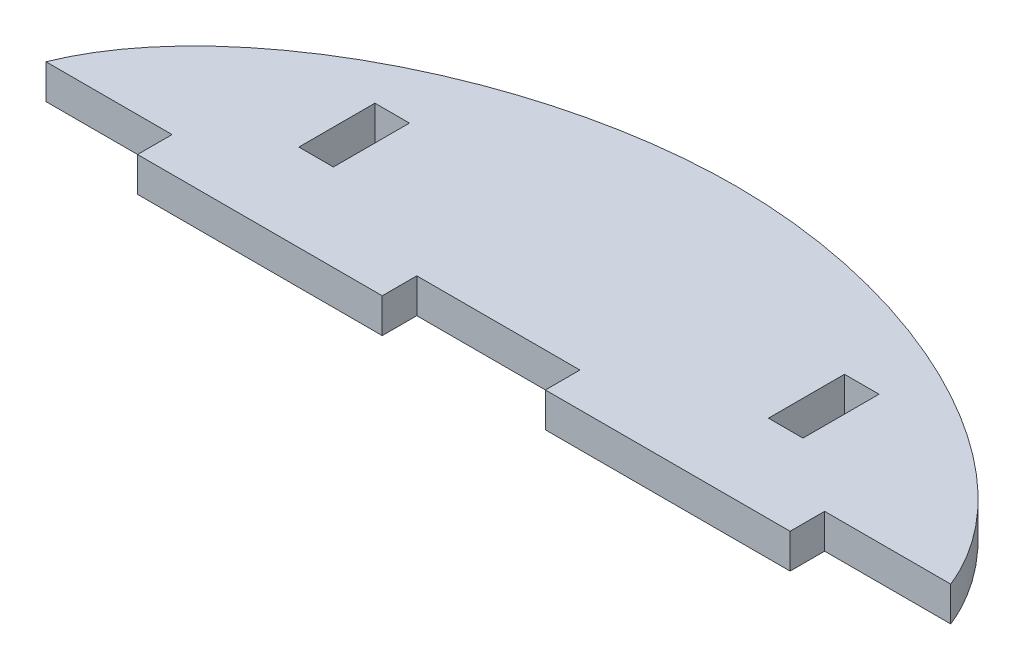
ISO-10303-21;
HEADER;
FILE_DESCRIPTION(('STEP AP214'),'2;1');
FILE_NAME('part.step','',(''),(''),'','','');
FILE_SCHEMA(('AUTOMOTIVE_DESIGN { 1 0 10303 214 1 1 1 1 }'));
ENDSEC;
DATA;
#1=APPLICATION_CONTEXT('core data for automotive mechanical design processes');
#2=APPLICATION_PROTOCOL_DEFINITION('international standard','automotive_design',2000,#1);
#3=PRODUCT_CONTEXT('',#1,'mechanical');
#4=PRODUCT('Part','Part','',(#3));
#5=PRODUCT_RELATED_PRODUCT_CATEGORY('part','',(#4));
#6=PRODUCT_DEFINITION_FORMATION('','',#4);
#7=PRODUCT_DEFINITION_CONTEXT('part definition',#1,'design');
#8=PRODUCT_DEFINITION('design','',#6,#7);
#9=PRODUCT_DEFINITION_SHAPE('','',#8);
#10=(LENGTH_UNIT() NAMED_UNIT(*) SI_UNIT(.MILLI.,.METRE.));
#11=(NAMED_UNIT(*) PLANE_ANGLE_UNIT() SI_UNIT($,.RADIAN.));
#12=(NAMED_UNIT(*) SI_UNIT($,.STERADIAN.) SOLID_ANGLE_UNIT());
#13=UNCERTAINTY_MEASURE_WITH_UNIT(LENGTH_MEASURE(1.E-05),#10,'distance_accuracy_value','');
#14=(GEOMETRIC_REPRESENTATION_CONTEXT(3) GLOBAL_UNCERTAINTY_ASSIGNED_CONTEXT((#13)) GLOBAL_UNIT_ASSIGNED_CONTEXT((#10,
#11,#12)) REPRESENTATION_CONTEXT('',''));
#15=CARTESIAN_POINT('',(0.,0.,0.));
#16=DIRECTION('',(0.,0.,1.));
#17=DIRECTION('',(1.,0.,0.));
#18=AXIS2_PLACEMENT_3D('',#15,#16,#17);
#19=CARTESIAN_POINT('',(0.,3.175,0.));
#20=DIRECTION('',(0.,0.,-1.));
#21=DIRECTION('',(-1.,0.,0.));
#22=AXIS2_PLACEMENT_3D('',#19,#20,#21);
#23=PLANE('',#22);
#24=DIRECTION('',(1.,0.,0.));
#25=VECTOR('',#24,1.);
#26=CARTESIAN_POINT('',(0.,3.175,0.));
#27=LINE('',#26,#25);
#28=CARTESIAN_POINT('',(50.,3.175,0.));
#29=VERTEX_POINT('',#28);
#30=CARTESIAN_POINT('',(72.5,3.175,0.));
#31=VERTEX_POINT('',#30);
#32=EDGE_CURVE('E294',#29,#31,#27,.T.);
#33=ORIENTED_EDGE('',*,*,#32,.F.);
#34=DIRECTION('',(0.,-1.,0.));
#35=VECTOR('',#34,1.);
#36=CARTESIAN_POINT('',(50.,3.175,0.));
#37=LINE('',#36,#35);
#38=CARTESIAN_POINT('',(50.,0.,0.));
#39=VERTEX_POINT('',#38);
#40=EDGE_CURVE('E198',#29,#39,#37,.T.);
#41=ORIENTED_EDGE('',*,*,#40,.T.);
#42=DIRECTION('',(1.,0.,0.));
#43=VECTOR('',#42,1.);
#44=CARTESIAN_POINT('',(0.,0.,0.));
#45=LINE('',#44,#43);
#46=CARTESIAN_POINT('',(72.5,0.,0.));
#47=VERTEX_POINT('',#46);
#48=EDGE_CURVE('E304',#39,#47,#45,.T.);
#49=ORIENTED_EDGE('',*,*,#48,.T.);
#50=DIRECTION('',(0.,-1.,0.));
#51=VECTOR('',#50,1.);
#52=CARTESIAN_POINT('',(72.5,3.175,0.));
#53=LINE('',#52,#51);
#54=EDGE_CURVE('E249',#31,#47,#53,.T.);
#55=ORIENTED_EDGE('',*,*,#54,.F.);
#56=EDGE_LOOP('',(#33,#41,#49,#55));
#57=FACE_BOUND('',#56,.T.);
#58=ADVANCED_FACE('F32',(#57),#23,.F.);
#59=CARTESIAN_POINT('',(0.,3.175,0.));
#60=CARTESIAN_POINT('',(2.31530903555912,3.175,-13.1307700401628));
#61=CARTESIAN_POINT('',(42.5000000000001,3.175,-36.8692299598373));
#62=CARTESIAN_POINT('',(82.6846909644409,3.175,-13.1307700401627));
#63=CARTESIAN_POINT('',(85.,3.175,0.));
#64=B_SPLINE_CURVE_WITH_KNOTS('',3,(#59,#60,#61,#62,#63),.UNSPECIFIED.,.F.,.F.,(4,1,4),(0.,
0.499999999999999,1.),.UNSPECIFIED.);
#65=DIRECTION('',(0.,-1.,0.));
#66=VECTOR('',#65,1.);
#67=SURFACE_OF_LINEAR_EXTRUSION('',#64,#66);
#68=DIRECTION('',(0.,-1.,0.));
#69=VECTOR('',#68,1.);
#70=CARTESIAN_POINT('',(0.908888664601335,3.175,-3.17499999999998));
#71=LINE('',#70,#69);
#72=CARTESIAN_POINT('',(0.908888664601547,3.175,-3.17499999999998));
#73=VERTEX_POINT('',#72);
#74=CARTESIAN_POINT('',(0.908888664601547,0.,-3.17500000000051));
#75=VERTEX_POINT('',#74);
#76=EDGE_CURVE('E256',#73,#75,#71,.T.);
#77=ORIENTED_EDGE('',*,*,#76,.F.);
#78=CARTESIAN_POINT('',(84.0911113353985,3.175,-3.17499999999997));
#79=VERTEX_POINT('',#78);
#80=EDGE_CURVE('E181',#73,#79,#64,.T.);
#81=ORIENTED_EDGE('',*,*,#80,.T.);
#82=DIRECTION('',(0.,-1.,0.));
#83=VECTOR('',#82,1.);
#84=CARTESIAN_POINT('',(84.0911113353986,3.175,-3.17499999999997));
#85=LINE('',#84,#83);
#86=CARTESIAN_POINT('',(84.0911113353985,0.,-3.17499999999997));
#87=VERTEX_POINT('',#86);
#88=EDGE_CURVE('E237',#87,#79,#85,.F.);
#89=ORIENTED_EDGE('',*,*,#88,.F.);
#90=CARTESIAN_POINT('',(0.,0.,0.));
#91=CARTESIAN_POINT('',(2.31530903555912,0.,-13.1307700401628));
#92=CARTESIAN_POINT('',(42.5000000000001,0.,-36.8692299598373));
#93=CARTESIAN_POINT('',(82.6846909644409,0.,-13.1307700401627));
#94=CARTESIAN_POINT('',(85.,0.,0.));
#95=B_SPLINE_CURVE_WITH_KNOTS('',3,(#90,#91,#92,#93,#94),.UNSPECIFIED.,.F.,.F.,(4,1,4),(0.,
0.499999999999999,1.),.UNSPECIFIED.);
#96=EDGE_CURVE('E284',#75,#87,#95,.T.);
#97=ORIENTED_EDGE('',*,*,#96,.F.);
#98=EDGE_LOOP('',(#77,#81,#89,#97));
#99=FACE_BOUND('',#98,.T.);
#100=ADVANCED_FACE('F34',(#99),#67,.T.);
#101=CARTESIAN_POINT('',(12.5,0.,0.));
#102=VERTEX_POINT('',#101);
#103=CARTESIAN_POINT('',(35.,0.,0.));
#104=VERTEX_POINT('',#103);
#105=EDGE_CURVE('E295',#102,#104,#45,.T.);
#106=ORIENTED_EDGE('',*,*,#105,.T.);
#107=DIRECTION('',(0.,-1.,0.));
#108=VECTOR('',#107,1.);
#109=CARTESIAN_POINT('',(35.,3.175,0.));
#110=LINE('',#109,#108);
#111=CARTESIAN_POINT('',(35.,3.175,0.));
#112=VERTEX_POINT('',#111);
#113=EDGE_CURVE('E209',#112,#104,#110,.T.);
#114=ORIENTED_EDGE('',*,*,#113,.F.);
#115=CARTESIAN_POINT('',(12.5,3.175,0.));
#116=VERTEX_POINT('',#115);
#117=EDGE_CURVE('E41',#116,#112,#27,.T.);
#118=ORIENTED_EDGE('',*,*,#117,.F.);
#119=DIRECTION('',(0.,-1.,0.));
#120=VECTOR('',#119,1.);
#121=CARTESIAN_POINT('',(12.5,3.175,0.));
#122=LINE('',#121,#120);
#123=EDGE_CURVE('E165',#116,#102,#122,.T.);
#124=ORIENTED_EDGE('',*,*,#123,.T.);
#125=EDGE_LOOP('',(#106,#114,#118,#124));
#126=FACE_BOUND('',#125,.T.);
#127=ADVANCED_FACE('F316',(#126),#23,.F.);
#128=CARTESIAN_POINT('',(0.,3.175,0.));
#129=DIRECTION('',(0.,1.,0.));
#130=DIRECTION('',(0.,0.,1.));
#131=AXIS2_PLACEMENT_3D('',#128,#129,#130);
#132=PLANE('',#131);
#133=DIRECTION('',(0.,0.,1.));
#134=VECTOR('',#133,1.);
#135=CARTESIAN_POINT('',(50.,3.175,0.));
#136=LINE('',#135,#134);
#137=CARTESIAN_POINT('',(50.,3.175,-3.17499999999997));
#138=VERTEX_POINT('',#137);
#139=EDGE_CURVE('E189',#138,#29,#136,.T.);
#140=ORIENTED_EDGE('',*,*,#139,.T.);
#141=ORIENTED_EDGE('',*,*,#32,.T.);
#142=DIRECTION('',(0.,0.,-1.));
#143=VECTOR('',#142,1.);
#144=CARTESIAN_POINT('',(72.5,3.175,0.));
#145=LINE('',#144,#143);
#146=CARTESIAN_POINT('',(72.5,3.175,-3.17499999999997));
#147=VERTEX_POINT('',#146);
#148=EDGE_CURVE('E243',#31,#147,#145,.T.);
#149=ORIENTED_EDGE('',*,*,#148,.T.);
#150=DIRECTION('',(1.,0.,0.));
#151=VECTOR('',#150,1.);
#152=CARTESIAN_POINT('',(85.,3.175,-3.17499999999997));
#153=LINE('',#152,#151);
#154=EDGE_CURVE('E246',#147,#79,#153,.T.);
#155=ORIENTED_EDGE('',*,*,#154,.T.);
#156=ORIENTED_EDGE('',*,*,#80,.F.);
#157=DIRECTION('',(1.,0.,0.));
#158=VECTOR('',#157,1.);
#159=CARTESIAN_POINT('',(0.,3.175,-3.17499999999998));
#160=LINE('',#159,#158);
#161=CARTESIAN_POINT('',(12.5,3.175,-3.17499999999998));
#162=VERTEX_POINT('',#161);
#163=EDGE_CURVE('E161',#73,#162,#160,.T.);
#164=ORIENTED_EDGE('',*,*,#163,.T.);
#165=DIRECTION('',(0.,0.,1.));
#166=VECTOR('',#165,1.);
#167=CARTESIAN_POINT('',(12.5,3.175,0.));
#168=LINE('',#167,#166);
#169=EDGE_CURVE('E166',#162,#116,#168,.T.);
#170=ORIENTED_EDGE('',*,*,#169,.T.);
#171=ORIENTED_EDGE('',*,*,#117,.T.);
#172=DIRECTION('',(0.,0.,-1.));
#173=VECTOR('',#172,1.);
#174=CARTESIAN_POINT('',(35.,3.175,0.));
#175=LINE('',#174,#173);
#176=CARTESIAN_POINT('',(35.,3.175,-3.17499999999997));
#177=VERTEX_POINT('',#176);
#178=EDGE_CURVE('E191',#112,#177,#175,.T.);
#179=ORIENTED_EDGE('',*,*,#178,.T.);
#180=DIRECTION('',(1.,0.,0.));
#181=VECTOR('',#180,1.);
#182=CARTESIAN_POINT('',(50.,3.175,-3.17499999999997));
#183=LINE('',#182,#181);
#184=EDGE_CURVE('E195',#177,#138,#183,.T.);
#185=ORIENTED_EDGE('',*,*,#184,.T.);
#186=EDGE_LOOP('',(#140,#141,#149,#155,#156,#164,#170,#171,#179,#185));
#187=FACE_BOUND('',#186,.T.);
#188=DIRECTION('',(0.,0.,1.));
#189=VECTOR('',#188,1.);
#190=CARTESIAN_POINT('',(22.4999999999998,3.175,-15.0000000000001));
#191=LINE('',#190,#189);
#192=CARTESIAN_POINT('',(22.4999999999998,3.175,-15.0000000000001));
#193=VERTEX_POINT('',#192);
#194=CARTESIAN_POINT('',(22.4999999999998,3.175,-8.00800000000014));
#195=VERTEX_POINT('',#194);
#196=EDGE_CURVE('E213',#193,#195,#191,.T.);
#197=ORIENTED_EDGE('',*,*,#196,.T.);
#198=DIRECTION('',(-1.,0.,0.));
#199=VECTOR('',#198,1.);
#200=CARTESIAN_POINT('',(22.4999999999998,3.175,-8.00800000000014));
#201=LINE('',#200,#199);
#202=CARTESIAN_POINT('',(19.3249999999999,3.175,-8.00800000000014));
#203=VERTEX_POINT('',#202);
#204=EDGE_CURVE('E216',#195,#203,#201,.T.);
#205=ORIENTED_EDGE('',*,*,#204,.T.);
#206=DIRECTION('',(0.,0.,-1.));
#207=VECTOR('',#206,1.);
#208=CARTESIAN_POINT('',(19.3249999999999,3.175,-15.0000000000001));
#209=LINE('',#208,#207);
#210=CARTESIAN_POINT('',(19.3249999999999,3.175,-15.0000000000001));
#211=VERTEX_POINT('',#210);
#212=EDGE_CURVE('E48',#203,#211,#209,.T.);
#213=ORIENTED_EDGE('',*,*,#212,.T.);
#214=DIRECTION('',(1.,0.,0.));
#215=VECTOR('',#214,1.);
#216=CARTESIAN_POINT('',(22.4999999999998,3.175,-15.0000000000001));
#217=LINE('',#216,#215);
#218=EDGE_CURVE('E221',#211,#193,#217,.T.);
#219=ORIENTED_EDGE('',*,*,#218,.T.);
#220=EDGE_LOOP('',(#197,#205,#213,#219));
#221=FACE_BOUND('',#220,.T.);
#222=DIRECTION('',(0.,0.,1.));
#223=VECTOR('',#222,1.);
#224=CARTESIAN_POINT('',(65.6749999999998,3.175,-15.0000000000005));
#225=LINE('',#224,#223);
#226=CARTESIAN_POINT('',(65.6749999999998,3.175,-15.0000000000005));
#227=VERTEX_POINT('',#226);
#228=CARTESIAN_POINT('',(65.6749999999998,3.175,-8.00800000000046));
#229=VERTEX_POINT('',#228);
#230=EDGE_CURVE('E259',#227,#229,#225,.T.);
#231=ORIENTED_EDGE('',*,*,#230,.T.);
#232=DIRECTION('',(-1.,0.,0.));
#233=VECTOR('',#232,1.);
#234=CARTESIAN_POINT('',(65.6749999999998,3.175,-8.00800000000046));
#235=LINE('',#234,#233);
#236=CARTESIAN_POINT('',(62.4999999999999,3.175,-8.00800000000046));
#237=VERTEX_POINT('',#236);
#238=EDGE_CURVE('E262',#229,#237,#235,.T.);
#239=ORIENTED_EDGE('',*,*,#238,.T.);
#240=DIRECTION('',(0.,0.,-1.));
#241=VECTOR('',#240,1.);
#242=CARTESIAN_POINT('',(62.4999999999999,3.175,-15.0000000000005));
#243=LINE('',#242,#241);
#244=CARTESIAN_POINT('',(62.4999999999999,3.175,-15.0000000000005));
#245=VERTEX_POINT('',#244);
#246=EDGE_CURVE('E266',#237,#245,#243,.T.);
#247=ORIENTED_EDGE('',*,*,#246,.T.);
#248=DIRECTION('',(1.,0.,0.));
#249=VECTOR('',#248,1.);
#250=CARTESIAN_POINT('',(65.6749999999998,3.175,-15.0000000000005));
#251=LINE('',#250,#249);
#252=EDGE_CURVE('E269',#245,#227,#251,.T.);
#253=ORIENTED_EDGE('',*,*,#252,.T.);
#254=EDGE_LOOP('',(#231,#239,#247,#253));
#255=FACE_BOUND('',#254,.T.);
#256=ADVANCED_FACE('F177',(#187,#221,#255),#132,.T.);
#257=CARTESIAN_POINT('',(0.,0.,0.));
#258=DIRECTION('',(0.,1.,0.));
#259=DIRECTION('',(0.,0.,1.));
#260=AXIS2_PLACEMENT_3D('',#257,#258,#259);
#261=PLANE('',#260);
#262=DIRECTION('',(-1.,0.,0.));
#263=VECTOR('',#262,1.);
#264=CARTESIAN_POINT('',(22.4999999999998,0.,-8.00800000000014));
#265=LINE('',#264,#263);
#266=CARTESIAN_POINT('',(22.4999999999998,0.,-8.00800000000014));
#267=VERTEX_POINT('',#266);
#268=CARTESIAN_POINT('',(19.3249999999999,0.,-8.00800000000014));
#269=VERTEX_POINT('',#268);
#270=EDGE_CURVE('E226',#267,#269,#265,.T.);
#271=ORIENTED_EDGE('',*,*,#270,.F.);
#272=DIRECTION('',(0.,0.,1.));
#273=VECTOR('',#272,1.);
#274=CARTESIAN_POINT('',(22.4999999999998,0.,-15.0000000000001));
#275=LINE('',#274,#273);
#276=CARTESIAN_POINT('',(22.4999999999998,0.,-15.0000000000001));
#277=VERTEX_POINT('',#276);
#278=EDGE_CURVE('E56',#277,#267,#275,.T.);
#279=ORIENTED_EDGE('',*,*,#278,.F.);
#280=DIRECTION('',(1.,0.,0.));
#281=VECTOR('',#280,1.);
#282=CARTESIAN_POINT('',(22.4999999999998,0.,-15.0000000000001));
#283=LINE('',#282,#281);
#284=CARTESIAN_POINT('',(19.3249999999999,0.,-15.0000000000001));
#285=VERTEX_POINT('',#284);
#286=EDGE_CURVE('E217',#285,#277,#283,.T.);
#287=ORIENTED_EDGE('',*,*,#286,.F.);
#288=DIRECTION('',(0.,0.,-1.));
#289=VECTOR('',#288,1.);
#290=CARTESIAN_POINT('',(19.3249999999999,0.,-15.0000000000001));
#291=LINE('',#290,#289);
#292=EDGE_CURVE('E230',#269,#285,#291,.T.);
#293=ORIENTED_EDGE('',*,*,#292,.F.);
#294=EDGE_LOOP('',(#271,#279,#287,#293));
#295=FACE_BOUND('',#294,.T.);
#296=DIRECTION('',(-1.,0.,0.));
#297=VECTOR('',#296,1.);
#298=CARTESIAN_POINT('',(65.6749999999998,0.,-8.00800000000046));
#299=LINE('',#298,#297);
#300=CARTESIAN_POINT('',(65.6749999999998,0.,-8.00800000000046));
#301=VERTEX_POINT('',#300);
#302=CARTESIAN_POINT('',(62.4999999999999,0.,-8.00800000000046));
#303=VERTEX_POINT('',#302);
#304=EDGE_CURVE('E274',#301,#303,#299,.T.);
#305=ORIENTED_EDGE('',*,*,#304,.F.);
#306=DIRECTION('',(0.,0.,1.));
#307=VECTOR('',#306,1.);
#308=CARTESIAN_POINT('',(65.6749999999998,0.,-15.0000000000005));
#309=LINE('',#308,#307);
#310=CARTESIAN_POINT('',(65.6749999999998,0.,-15.0000000000005));
#311=VERTEX_POINT('',#310);
#312=EDGE_CURVE('E258',#311,#301,#309,.T.);
#313=ORIENTED_EDGE('',*,*,#312,.F.);
#314=DIRECTION('',(1.,0.,0.));
#315=VECTOR('',#314,1.);
#316=CARTESIAN_POINT('',(65.6749999999998,0.,-15.0000000000005));
#317=LINE('',#316,#315);
#318=CARTESIAN_POINT('',(62.4999999999999,0.,-15.0000000000005));
#319=VERTEX_POINT('',#318);
#320=EDGE_CURVE('E263',#319,#311,#317,.T.);
#321=ORIENTED_EDGE('',*,*,#320,.F.);
#322=DIRECTION('',(0.,0.,-1.));
#323=VECTOR('',#322,1.);
#324=CARTESIAN_POINT('',(62.4999999999999,0.,-15.0000000000005));
#325=LINE('',#324,#323);
#326=EDGE_CURVE('E277',#303,#319,#325,.T.);
#327=ORIENTED_EDGE('',*,*,#326,.F.);
#328=EDGE_LOOP('',(#305,#313,#321,#327));
#329=FACE_BOUND('',#328,.T.);
#330=ORIENTED_EDGE('',*,*,#48,.F.);
#331=DIRECTION('',(0.,0.,1.));
#332=VECTOR('',#331,1.);
#333=CARTESIAN_POINT('',(50.,0.,0.));
#334=LINE('',#333,#332);
#335=CARTESIAN_POINT('',(50.,0.,-3.17499999999997));
#336=VERTEX_POINT('',#335);
#337=EDGE_CURVE('E199',#336,#39,#334,.T.);
#338=ORIENTED_EDGE('',*,*,#337,.F.);
#339=DIRECTION('',(1.,0.,0.));
#340=VECTOR('',#339,1.);
#341=CARTESIAN_POINT('',(50.,0.,-3.17499999999997));
#342=LINE('',#341,#340);
#343=CARTESIAN_POINT('',(35.,0.,-3.17499999999997));
#344=VERTEX_POINT('',#343);
#345=EDGE_CURVE('E192',#344,#336,#342,.T.);
#346=ORIENTED_EDGE('',*,*,#345,.F.);
#347=DIRECTION('',(0.,0.,-1.));
#348=VECTOR('',#347,1.);
#349=CARTESIAN_POINT('',(35.,0.,0.));
#350=LINE('',#349,#348);
#351=EDGE_CURVE('E201',#104,#344,#350,.T.);
#352=ORIENTED_EDGE('',*,*,#351,.F.);
#353=ORIENTED_EDGE('',*,*,#105,.F.);
#354=DIRECTION('',(0.,0.,1.));
#355=VECTOR('',#354,1.);
#356=CARTESIAN_POINT('',(12.5,0.,0.));
#357=LINE('',#356,#355);
#358=CARTESIAN_POINT('',(12.5,0.,-3.17499999999998));
#359=VERTEX_POINT('',#358);
#360=EDGE_CURVE('E182',#359,#102,#357,.T.);
#361=ORIENTED_EDGE('',*,*,#360,.F.);
#362=DIRECTION('',(-1.,0.,0.));
#363=VECTOR('',#362,1.);
#364=CARTESIAN_POINT('',(0.,0.,-3.17499999999998));
#365=LINE('',#364,#363);
#366=EDGE_CURVE('E11',#359,#75,#365,.T.);
#367=ORIENTED_EDGE('',*,*,#366,.T.);
#368=ORIENTED_EDGE('',*,*,#96,.T.);
#369=DIRECTION('',(1.,0.,0.));
#370=VECTOR('',#369,1.);
#371=CARTESIAN_POINT('',(85.,0.,-3.17499999999997));
#372=LINE('',#371,#370);
#373=CARTESIAN_POINT('',(72.5,0.,-3.17499999999997));
#374=VERTEX_POINT('',#373);
#375=EDGE_CURVE('E247',#374,#87,#372,.T.);
#376=ORIENTED_EDGE('',*,*,#375,.F.);
#377=DIRECTION('',(0.,0.,-1.));
#378=VECTOR('',#377,1.);
#379=CARTESIAN_POINT('',(72.5,0.,0.));
#380=LINE('',#379,#378);
#381=EDGE_CURVE('E187',#47,#374,#380,.T.);
#382=ORIENTED_EDGE('',*,*,#381,.F.);
#383=EDGE_LOOP('',(#330,#338,#346,#352,#353,#361,#367,#368,#376,#382));
#384=FACE_BOUND('',#383,.T.);
#385=ADVANCED_FACE('F319',(#295,#329,#384),#261,.F.);
#386=CARTESIAN_POINT('',(65.6749999999998,3.175,-15.0000000000005));
#387=DIRECTION('',(1.,0.,0.));
#388=DIRECTION('',(0.,0.,-1.));
#389=AXIS2_PLACEMENT_3D('',#386,#387,#388);
#390=PLANE('',#389);
#391=ORIENTED_EDGE('',*,*,#312,.T.);
#392=DIRECTION('',(0.,-1.,0.));
#393=VECTOR('',#392,1.);
#394=CARTESIAN_POINT('',(65.6749999999998,3.175,-8.00800000000046));
#395=LINE('',#394,#393);
#396=EDGE_CURVE('E272',#229,#301,#395,.T.);
#397=ORIENTED_EDGE('',*,*,#396,.F.);
#398=ORIENTED_EDGE('',*,*,#230,.F.);
#399=DIRECTION('',(0.,-1.,0.));
#400=VECTOR('',#399,1.);
#401=CARTESIAN_POINT('',(65.6749999999998,3.175,-15.0000000000005));
#402=LINE('',#401,#400);
#403=EDGE_CURVE('E282',#227,#311,#402,.T.);
#404=ORIENTED_EDGE('',*,*,#403,.T.);
#405=EDGE_LOOP('',(#391,#397,#398,#404));
#406=FACE_BOUND('',#405,.T.);
#407=ADVANCED_FACE('F366',(#406),#390,.F.);
#408=CARTESIAN_POINT('',(65.6749999999998,3.175,-15.0000000000005));
#409=DIRECTION('',(0.,0.,-1.));
#410=DIRECTION('',(-1.,0.,0.));
#411=AXIS2_PLACEMENT_3D('',#408,#409,#410);
#412=PLANE('',#411);
#413=ORIENTED_EDGE('',*,*,#320,.T.);
#414=ORIENTED_EDGE('',*,*,#403,.F.);
#415=ORIENTED_EDGE('',*,*,#252,.F.);
#416=DIRECTION('',(0.,-1.,0.));
#417=VECTOR('',#416,1.);
#418=CARTESIAN_POINT('',(62.4999999999999,3.175,-15.0000000000005));
#419=LINE('',#418,#417);
#420=EDGE_CURVE('E285',#245,#319,#419,.T.);
#421=ORIENTED_EDGE('',*,*,#420,.T.);
#422=EDGE_LOOP('',(#413,#414,#415,#421));
#423=FACE_BOUND('',#422,.T.);
#424=ADVANCED_FACE('F371',(#423),#412,.F.);
#425=CARTESIAN_POINT('',(62.4999999999999,3.175,-15.0000000000005));
#426=DIRECTION('',(-1.,0.,0.));
#427=DIRECTION('',(0.,0.,1.));
#428=AXIS2_PLACEMENT_3D('',#425,#426,#427);
#429=PLANE('',#428);
#430=ORIENTED_EDGE('',*,*,#326,.T.);
#431=ORIENTED_EDGE('',*,*,#420,.F.);
#432=ORIENTED_EDGE('',*,*,#246,.F.);
#433=DIRECTION('',(0.,-1.,0.));
#434=VECTOR('',#433,1.);
#435=CARTESIAN_POINT('',(62.4999999999999,3.175,-8.00800000000046));
#436=LINE('',#435,#434);
#437=EDGE_CURVE('E287',#237,#303,#436,.T.);
#438=ORIENTED_EDGE('',*,*,#437,.T.);
#439=EDGE_LOOP('',(#430,#431,#432,#438));
#440=FACE_BOUND('',#439,.T.);
#441=ADVANCED_FACE('F377',(#440),#429,.F.);
#442=CARTESIAN_POINT('',(65.6749999999998,3.175,-8.00800000000046));
#443=DIRECTION('',(0.,0.,1.));
#444=DIRECTION('',(1.,0.,0.));
#445=AXIS2_PLACEMENT_3D('',#442,#443,#444);
#446=PLANE('',#445);
#447=ORIENTED_EDGE('',*,*,#304,.T.);
#448=ORIENTED_EDGE('',*,*,#437,.F.);
#449=ORIENTED_EDGE('',*,*,#238,.F.);
#450=ORIENTED_EDGE('',*,*,#396,.T.);
#451=EDGE_LOOP('',(#447,#448,#449,#450));
#452=FACE_BOUND('',#451,.T.);
#453=ADVANCED_FACE('F373',(#452),#446,.F.);
#454=CARTESIAN_POINT('',(22.4999999999998,3.175,-15.0000000000001));
#455=DIRECTION('',(1.,0.,0.));
#456=DIRECTION('',(0.,0.,-1.));
#457=AXIS2_PLACEMENT_3D('',#454,#455,#456);
#458=PLANE('',#457);
#459=ORIENTED_EDGE('',*,*,#278,.T.);
#460=DIRECTION('',(0.,-1.,0.));
#461=VECTOR('',#460,1.);
#462=CARTESIAN_POINT('',(22.4999999999998,3.175,-8.00800000000014));
#463=LINE('',#462,#461);
#464=EDGE_CURVE('E224',#195,#267,#463,.T.);
#465=ORIENTED_EDGE('',*,*,#464,.F.);
#466=ORIENTED_EDGE('',*,*,#196,.F.);
#467=DIRECTION('',(0.,-1.,0.));
#468=VECTOR('',#467,1.);
#469=CARTESIAN_POINT('',(22.4999999999998,3.175,-15.0000000000001));
#470=LINE('',#469,#468);
#471=EDGE_CURVE('E235',#193,#277,#470,.T.);
#472=ORIENTED_EDGE('',*,*,#471,.T.);
#473=EDGE_LOOP('',(#459,#465,#466,#472));
#474=FACE_BOUND('',#473,.T.);
#475=ADVANCED_FACE('F376',(#474),#458,.F.);
#476=CARTESIAN_POINT('',(22.4999999999998,3.175,-15.0000000000001));
#477=DIRECTION('',(0.,0.,-1.));
#478=DIRECTION('',(-1.,0.,0.));
#479=AXIS2_PLACEMENT_3D('',#476,#477,#478);
#480=PLANE('',#479);
#481=ORIENTED_EDGE('',*,*,#286,.T.);
#482=ORIENTED_EDGE('',*,*,#471,.F.);
#483=ORIENTED_EDGE('',*,*,#218,.F.);
#484=DIRECTION('',(0.,-1.,0.));
#485=VECTOR('',#484,1.);
#486=CARTESIAN_POINT('',(19.3249999999999,3.175,-15.0000000000001));
#487=LINE('',#486,#485);
#488=EDGE_CURVE('E238',#211,#285,#487,.T.);
#489=ORIENTED_EDGE('',*,*,#488,.T.);
#490=EDGE_LOOP('',(#481,#482,#483,#489));
#491=FACE_BOUND('',#490,.T.);
#492=ADVANCED_FACE('F412',(#491),#480,.F.);
#493=CARTESIAN_POINT('',(19.3249999999999,3.175,-15.0000000000001));
#494=DIRECTION('',(-1.,0.,0.));
#495=DIRECTION('',(0.,0.,1.));
#496=AXIS2_PLACEMENT_3D('',#493,#494,#495);
#497=PLANE('',#496);
#498=ORIENTED_EDGE('',*,*,#292,.T.);
#499=ORIENTED_EDGE('',*,*,#488,.F.);
#500=ORIENTED_EDGE('',*,*,#212,.F.);
#501=DIRECTION('',(0.,-1.,0.));
#502=VECTOR('',#501,1.);
#503=CARTESIAN_POINT('',(19.3249999999999,3.175,-8.00800000000014));
#504=LINE('',#503,#502);
#505=EDGE_CURVE('E240',#203,#269,#504,.T.);
#506=ORIENTED_EDGE('',*,*,#505,.T.);
#507=EDGE_LOOP('',(#498,#499,#500,#506));
#508=FACE_BOUND('',#507,.T.);
#509=ADVANCED_FACE('F349',(#508),#497,.F.);
#510=CARTESIAN_POINT('',(22.4999999999998,3.175,-8.00800000000014));
#511=DIRECTION('',(0.,0.,1.));
#512=DIRECTION('',(1.,0.,0.));
#513=AXIS2_PLACEMENT_3D('',#510,#511,#512);
#514=PLANE('',#513);
#515=ORIENTED_EDGE('',*,*,#270,.T.);
#516=ORIENTED_EDGE('',*,*,#505,.F.);
#517=ORIENTED_EDGE('',*,*,#204,.F.);
#518=ORIENTED_EDGE('',*,*,#464,.T.);
#519=EDGE_LOOP('',(#515,#516,#517,#518));
#520=FACE_BOUND('',#519,.T.);
#521=ADVANCED_FACE('F342',(#520),#514,.F.);
#522=CARTESIAN_POINT('',(85.,3.175,-3.17499999999997));
#523=DIRECTION('',(0.,0.,-1.));
#524=DIRECTION('',(-1.,0.,0.));
#525=AXIS2_PLACEMENT_3D('',#522,#523,#524);
#526=PLANE('',#525);
#527=ORIENTED_EDGE('',*,*,#88,.T.);
#528=ORIENTED_EDGE('',*,*,#154,.F.);
#529=DIRECTION('',(0.,-1.,0.));
#530=VECTOR('',#529,1.);
#531=CARTESIAN_POINT('',(72.5,3.175,-3.17499999999997));
#532=LINE('',#531,#530);
#533=EDGE_CURVE('E227',#147,#374,#532,.T.);
#534=ORIENTED_EDGE('',*,*,#533,.T.);
#535=ORIENTED_EDGE('',*,*,#375,.T.);
#536=EDGE_LOOP('',(#527,#528,#534,#535));
#537=FACE_BOUND('',#536,.T.);
#538=ADVANCED_FACE('F340',(#537),#526,.F.);
#539=CARTESIAN_POINT('',(72.5,3.175,0.));
#540=DIRECTION('',(-1.,0.,0.));
#541=DIRECTION('',(0.,0.,1.));
#542=AXIS2_PLACEMENT_3D('',#539,#540,#541);
#543=PLANE('',#542);
#544=ORIENTED_EDGE('',*,*,#381,.T.);
#545=ORIENTED_EDGE('',*,*,#533,.F.);
#546=ORIENTED_EDGE('',*,*,#148,.F.);
#547=ORIENTED_EDGE('',*,*,#54,.T.);
#548=EDGE_LOOP('',(#544,#545,#546,#547));
#549=FACE_BOUND('',#548,.T.);
#550=ADVANCED_FACE('F334',(#549),#543,.F.);
#551=CARTESIAN_POINT('',(12.5,3.175,0.));
#552=DIRECTION('',(1.,0.,0.));
#553=DIRECTION('',(0.,0.,-1.));
#554=AXIS2_PLACEMENT_3D('',#551,#552,#553);
#555=PLANE('',#554);
#556=ORIENTED_EDGE('',*,*,#360,.T.);
#557=ORIENTED_EDGE('',*,*,#123,.F.);
#558=ORIENTED_EDGE('',*,*,#169,.F.);
#559=DIRECTION('',(0.,-1.,0.));
#560=VECTOR('',#559,1.);
#561=CARTESIAN_POINT('',(12.5,3.175,-3.17499999999998));
#562=LINE('',#561,#560);
#563=EDGE_CURVE('E157',#162,#359,#562,.T.);
#564=ORIENTED_EDGE('',*,*,#563,.T.);
#565=EDGE_LOOP('',(#556,#557,#558,#564));
#566=FACE_BOUND('',#565,.T.);
#567=ADVANCED_FACE('F169',(#566),#555,.F.);
#568=CARTESIAN_POINT('',(0.,3.175,-3.17499999999998));
#569=DIRECTION('',(0.,0.,-1.));
#570=DIRECTION('',(-1.,0.,0.));
#571=AXIS2_PLACEMENT_3D('',#568,#569,#570);
#572=PLANE('',#571);
#573=ORIENTED_EDGE('',*,*,#76,.T.);
#574=ORIENTED_EDGE('',*,*,#366,.F.);
#575=ORIENTED_EDGE('',*,*,#563,.F.);
#576=ORIENTED_EDGE('',*,*,#163,.F.);
#577=EDGE_LOOP('',(#573,#574,#575,#576));
#578=FACE_BOUND('',#577,.T.);
#579=ADVANCED_FACE('F159',(#578),#572,.F.);
#580=CARTESIAN_POINT('',(50.,3.175,0.));
#581=DIRECTION('',(1.,0.,0.));
#582=DIRECTION('',(0.,0.,-1.));
#583=AXIS2_PLACEMENT_3D('',#580,#581,#582);
#584=PLANE('',#583);
#585=ORIENTED_EDGE('',*,*,#337,.T.);
#586=ORIENTED_EDGE('',*,*,#40,.F.);
#587=ORIENTED_EDGE('',*,*,#139,.F.);
#588=DIRECTION('',(0.,-1.,0.));
#589=VECTOR('',#588,1.);
#590=CARTESIAN_POINT('',(50.,3.175,-3.17499999999997));
#591=LINE('',#590,#589);
#592=EDGE_CURVE('E184',#138,#336,#591,.T.);
#593=ORIENTED_EDGE('',*,*,#592,.T.);
#594=EDGE_LOOP('',(#585,#586,#587,#593));
#595=FACE_BOUND('',#594,.T.);
#596=ADVANCED_FACE('F330',(#595),#584,.F.);
#597=CARTESIAN_POINT('',(50.,3.175,-3.17499999999997));
#598=DIRECTION('',(0.,0.,-1.));
#599=DIRECTION('',(-1.,0.,0.));
#600=AXIS2_PLACEMENT_3D('',#597,#598,#599);
#601=PLANE('',#600);
#602=ORIENTED_EDGE('',*,*,#345,.T.);
#603=ORIENTED_EDGE('',*,*,#592,.F.);
#604=ORIENTED_EDGE('',*,*,#184,.F.);
#605=DIRECTION('',(0.,-1.,0.));
#606=VECTOR('',#605,1.);
#607=CARTESIAN_POINT('',(35.,3.175,-3.17499999999997));
#608=LINE('',#607,#606);
#609=EDGE_CURVE('E207',#177,#344,#608,.T.);
#610=ORIENTED_EDGE('',*,*,#609,.T.);
#611=EDGE_LOOP('',(#602,#603,#604,#610));
#612=FACE_BOUND('',#611,.T.);
#613=ADVANCED_FACE('F328',(#612),#601,.F.);
#614=CARTESIAN_POINT('',(35.,3.175,0.));
#615=DIRECTION('',(-1.,0.,0.));
#616=DIRECTION('',(0.,0.,1.));
#617=AXIS2_PLACEMENT_3D('',#614,#615,#616);
#618=PLANE('',#617);
#619=ORIENTED_EDGE('',*,*,#351,.T.);
#620=ORIENTED_EDGE('',*,*,#609,.F.);
#621=ORIENTED_EDGE('',*,*,#178,.F.);
#622=ORIENTED_EDGE('',*,*,#113,.T.);
#623=EDGE_LOOP('',(#619,#620,#621,#622));
#624=FACE_BOUND('',#623,.T.);
#625=ADVANCED_FACE('F323',(#624),#618,.F.);
#626=CLOSED_SHELL('',(#58,#100,#127,#256,#385,#407,#424,#441,#453,#475,#492,#509,#521,#538,#550,
#567,#579,#596,#613,#625));
#627=MANIFOLD_SOLID_BREP('B2',#626);
#628=ADVANCED_BREP_SHAPE_REPRESENTATION('',(#18,#627),#14);
#629=SHAPE_DEFINITION_REPRESENTATION(#9,#628);
ENDSEC;
END-ISO-10303-21;
